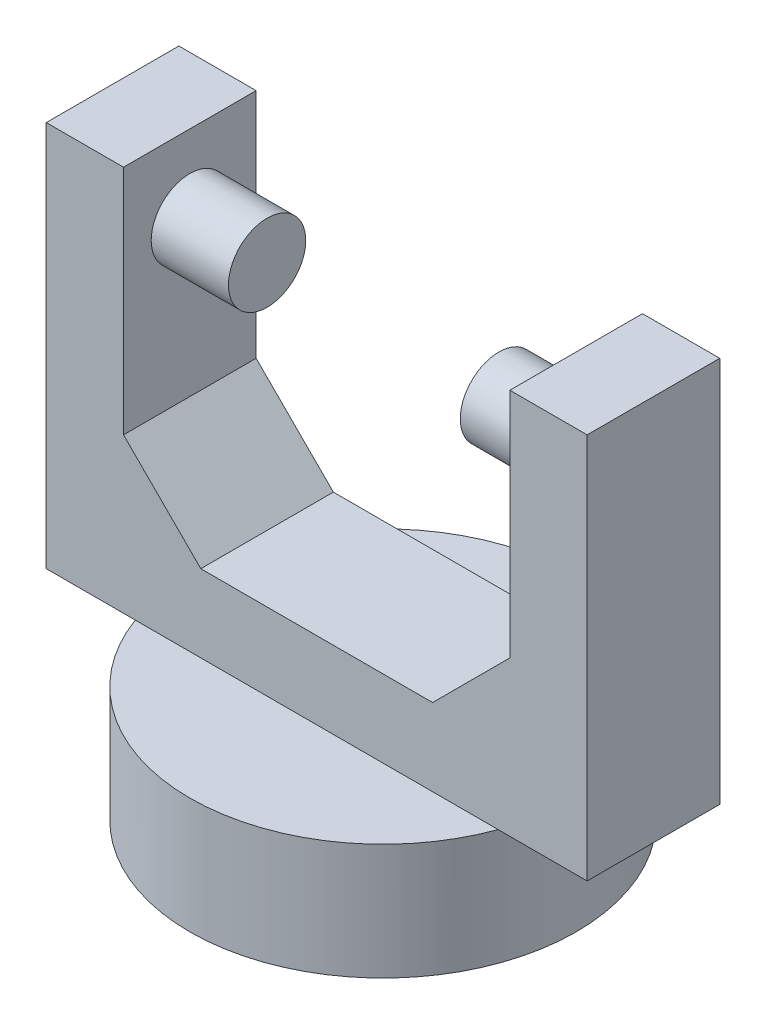
ISO-10303-21;
HEADER;
FILE_DESCRIPTION(('STEP AP214'),'2;1');
FILE_NAME('part.step','',(''),(''),'','','');
FILE_SCHEMA(('AUTOMOTIVE_DESIGN { 1 0 10303 214 1 1 1 1 }'));
ENDSEC;
DATA;
#1=APPLICATION_CONTEXT('core data for automotive mechanical design processes');
#2=APPLICATION_PROTOCOL_DEFINITION('international standard','automotive_design',2000,#1);
#3=PRODUCT_CONTEXT('',#1,'mechanical');
#4=PRODUCT('Part','Part','',(#3));
#5=PRODUCT_RELATED_PRODUCT_CATEGORY('part','',(#4));
#6=PRODUCT_DEFINITION_FORMATION('','',#4);
#7=PRODUCT_DEFINITION_CONTEXT('part definition',#1,'design');
#8=PRODUCT_DEFINITION('design','',#6,#7);
#9=PRODUCT_DEFINITION_SHAPE('','',#8);
#10=(LENGTH_UNIT() NAMED_UNIT(*) SI_UNIT(.MILLI.,.METRE.));
#11=(NAMED_UNIT(*) PLANE_ANGLE_UNIT() SI_UNIT($,.RADIAN.));
#12=(NAMED_UNIT(*) SI_UNIT($,.STERADIAN.) SOLID_ANGLE_UNIT());
#13=UNCERTAINTY_MEASURE_WITH_UNIT(LENGTH_MEASURE(1.E-05),#10,'distance_accuracy_value','');
#14=(GEOMETRIC_REPRESENTATION_CONTEXT(3) GLOBAL_UNCERTAINTY_ASSIGNED_CONTEXT((#13)) GLOBAL_UNIT_ASSIGNED_CONTEXT((#10,
#11,#12)) REPRESENTATION_CONTEXT('',''));
#15=CARTESIAN_POINT('',(0.,0.,0.));
#16=DIRECTION('',(0.,0.,1.));
#17=DIRECTION('',(1.,0.,0.));
#18=AXIS2_PLACEMENT_3D('',#15,#16,#17);
#19=CARTESIAN_POINT('',(0.,32.5,0.));
#20=DIRECTION('',(0.,1.,0.));
#21=DIRECTION('',(0.,0.,1.));
#22=AXIS2_PLACEMENT_3D('',#19,#20,#21);
#23=PLANE('',#22);
#24=DIRECTION('',(0.,0.,1.));
#25=VECTOR('',#24,1.);
#26=CARTESIAN_POINT('',(-12.5,32.5,-4.29038395748194));
#27=LINE('',#26,#25);
#28=CARTESIAN_POINT('',(-12.5,32.5,-4.29038395748194));
#29=VERTEX_POINT('',#28);
#30=CARTESIAN_POINT('',(-12.5,32.5,4.29038395748193));
#31=VERTEX_POINT('',#30);
#32=EDGE_CURVE('E142',#29,#31,#27,.T.);
#33=ORIENTED_EDGE('',*,*,#32,.F.);
#34=DIRECTION('',(-1.,0.,0.));
#35=VECTOR('',#34,1.);
#36=CARTESIAN_POINT('',(-17.5,32.5,-4.29038395748194));
#37=LINE('',#36,#35);
#38=CARTESIAN_POINT('',(-17.5,32.5,-4.29038395748194));
#39=VERTEX_POINT('',#38);
#40=EDGE_CURVE('E161',#29,#39,#37,.T.);
#41=ORIENTED_EDGE('',*,*,#40,.T.);
#42=DIRECTION('',(0.,0.,1.));
#43=VECTOR('',#42,1.);
#44=CARTESIAN_POINT('',(-17.5,32.5,-4.29038395748194));
#45=LINE('',#44,#43);
#46=CARTESIAN_POINT('',(-17.5,32.5,4.29038395748193));
#47=VERTEX_POINT('',#46);
#48=EDGE_CURVE('E153',#39,#47,#45,.T.);
#49=ORIENTED_EDGE('',*,*,#48,.T.);
#50=DIRECTION('',(1.,0.,0.));
#51=VECTOR('',#50,1.);
#52=CARTESIAN_POINT('',(-17.5,32.5,4.29038395748193));
#53=LINE('',#52,#51);
#54=EDGE_CURVE('E132',#47,#31,#53,.T.);
#55=ORIENTED_EDGE('',*,*,#54,.T.);
#56=EDGE_LOOP('',(#33,#41,#49,#55));
#57=FACE_BOUND('',#56,.T.);
#58=ADVANCED_FACE('F39',(#57),#23,.T.);
#59=CARTESIAN_POINT('',(0.,7.5,0.));
#60=DIRECTION('',(0.,1.,0.));
#61=DIRECTION('',(0.,0.,1.));
#62=AXIS2_PLACEMENT_3D('',#59,#60,#61);
#63=PLANE('',#62);
#64=DIRECTION('',(-1.,0.,0.));
#65=VECTOR('',#64,1.);
#66=CARTESIAN_POINT('',(-17.5,7.5,-4.29038395748194));
#67=LINE('',#66,#65);
#68=CARTESIAN_POINT('',(11.7406390583044,7.5,-4.29038395748194));
#69=VERTEX_POINT('',#68);
#70=CARTESIAN_POINT('',(-11.7406390583044,7.5,-4.29038395748194));
#71=VERTEX_POINT('',#70);
#72=EDGE_CURVE('E188',#69,#71,#67,.T.);
#73=ORIENTED_EDGE('',*,*,#72,.F.);
#74=CARTESIAN_POINT('',(0.,7.5,0.));
#75=DIRECTION('',(0.,1.,0.));
#76=DIRECTION('',(0.,0.,1.));
#77=AXIS2_PLACEMENT_3D('',#74,#75,#76);
#78=CIRCLE('',#77,12.5);
#79=EDGE_CURVE('E208',#69,#71,#78,.T.);
#80=ORIENTED_EDGE('',*,*,#79,.T.);
#81=EDGE_LOOP('',(#73,#80));
#82=FACE_BOUND('',#81,.T.);
#83=ADVANCED_FACE('F318',(#82),#63,.T.);
#84=CARTESIAN_POINT('',(0.,7.5,0.));
#85=DIRECTION('',(0.,-1.,0.));
#86=DIRECTION('',(0.,0.,-1.));
#87=AXIS2_PLACEMENT_3D('',#84,#85,#86);
#88=CYLINDRICAL_SURFACE('',#87,12.5);
#89=CARTESIAN_POINT('',(11.7406390583043,7.5,4.29038395748194));
#90=VERTEX_POINT('',#89);
#91=EDGE_CURVE('E204',#90,#69,#78,.T.);
#92=ORIENTED_EDGE('',*,*,#91,.F.);
#93=CARTESIAN_POINT('',(-11.7406390583044,7.5,4.29038395748193));
#94=VERTEX_POINT('',#93);
#95=EDGE_CURVE('E209',#94,#90,#78,.T.);
#96=ORIENTED_EDGE('',*,*,#95,.F.);
#97=EDGE_CURVE('E247',#71,#94,#78,.T.);
#98=ORIENTED_EDGE('',*,*,#97,.F.);
#99=ORIENTED_EDGE('',*,*,#79,.F.);
#100=EDGE_LOOP('',(#92,#96,#98,#99));
#101=FACE_BOUND('',#100,.T.);
#102=CARTESIAN_POINT('',(0.,0.,0.));
#103=DIRECTION('',(0.,1.,0.));
#104=DIRECTION('',(0.,0.,1.));
#105=AXIS2_PLACEMENT_3D('',#102,#103,#104);
#106=CIRCLE('',#105,12.5);
#107=CARTESIAN_POINT('',(0.,0.,12.5));
#108=VERTEX_POINT('',#107);
#109=EDGE_CURVE('E203',#108,#108,#106,.T.);
#110=ORIENTED_EDGE('',*,*,#109,.T.);
#111=EDGE_LOOP('',(#110));
#112=FACE_BOUND('',#111,.T.);
#113=ADVANCED_FACE('F324',(#101,#112),#88,.T.);
#114=DIRECTION('',(1.,0.,0.));
#115=VECTOR('',#114,1.);
#116=CARTESIAN_POINT('',(-17.5,7.5,4.29038395748193));
#117=LINE('',#116,#115);
#118=EDGE_CURVE('E180',#94,#90,#117,.T.);
#119=ORIENTED_EDGE('',*,*,#118,.F.);
#120=ORIENTED_EDGE('',*,*,#95,.T.);
#121=EDGE_LOOP('',(#119,#120));
#122=FACE_BOUND('',#121,.T.);
#123=ADVANCED_FACE('F327',(#122),#63,.T.);
#124=CARTESIAN_POINT('',(0.,0.,0.));
#125=DIRECTION('',(0.,1.,0.));
#126=DIRECTION('',(0.,0.,1.));
#127=AXIS2_PLACEMENT_3D('',#124,#125,#126);
#128=PLANE('',#127);
#129=ORIENTED_EDGE('',*,*,#109,.F.);
#130=EDGE_LOOP('',(#129));
#131=FACE_BOUND('',#130,.T.);
#132=ADVANCED_FACE('F361',(#131),#128,.F.);
#133=CARTESIAN_POINT('',(0.,7.5,0.));
#134=DIRECTION('',(0.,1.,0.));
#135=DIRECTION('',(0.,0.,1.));
#136=AXIS2_PLACEMENT_3D('',#133,#134,#135);
#137=PLANE('',#136);
#138=CARTESIAN_POINT('',(17.5,7.5,4.29038395748194));
#139=VERTEX_POINT('',#138);
#140=EDGE_CURVE('E174',#90,#139,#117,.T.);
#141=ORIENTED_EDGE('',*,*,#140,.F.);
#142=ORIENTED_EDGE('',*,*,#91,.T.);
#143=CARTESIAN_POINT('',(17.5,7.5,-4.29038395748194));
#144=VERTEX_POINT('',#143);
#145=EDGE_CURVE('E184',#144,#69,#67,.T.);
#146=ORIENTED_EDGE('',*,*,#145,.F.);
#147=DIRECTION('',(0.,0.,-1.));
#148=VECTOR('',#147,1.);
#149=CARTESIAN_POINT('',(17.5,7.5,-4.29038395748194));
#150=LINE('',#149,#148);
#151=EDGE_CURVE('E179',#139,#144,#150,.T.);
#152=ORIENTED_EDGE('',*,*,#151,.F.);
#153=EDGE_LOOP('',(#141,#142,#146,#152));
#154=FACE_BOUND('',#153,.T.);
#155=ADVANCED_FACE('F347',(#154),#137,.F.);
#156=CARTESIAN_POINT('',(-17.5,7.5,-4.29038395748194));
#157=VERTEX_POINT('',#156);
#158=EDGE_CURVE('E183',#71,#157,#67,.T.);
#159=ORIENTED_EDGE('',*,*,#158,.F.);
#160=ORIENTED_EDGE('',*,*,#97,.T.);
#161=CARTESIAN_POINT('',(-17.5,7.5,4.29038395748193));
#162=VERTEX_POINT('',#161);
#163=EDGE_CURVE('E175',#162,#94,#117,.T.);
#164=ORIENTED_EDGE('',*,*,#163,.F.);
#165=DIRECTION('',(0.,0.,1.));
#166=VECTOR('',#165,1.);
#167=CARTESIAN_POINT('',(-17.5,7.5,-4.29038395748194));
#168=LINE('',#167,#166);
#169=EDGE_CURVE('E170',#157,#162,#168,.T.);
#170=ORIENTED_EDGE('',*,*,#169,.F.);
#171=EDGE_LOOP('',(#159,#160,#164,#170));
#172=FACE_BOUND('',#171,.T.);
#173=ADVANCED_FACE('F354',(#172),#137,.F.);
#174=CARTESIAN_POINT('',(-17.5,32.5,-4.29038395748194));
#175=DIRECTION('',(1.,0.,0.));
#176=DIRECTION('',(0.,0.,-1.));
#177=AXIS2_PLACEMENT_3D('',#174,#175,#176);
#178=PLANE('',#177);
#179=ORIENTED_EDGE('',*,*,#169,.T.);
#180=DIRECTION('',(0.,-1.,0.));
#181=VECTOR('',#180,1.);
#182=CARTESIAN_POINT('',(-17.5,32.5,4.29038395748193));
#183=LINE('',#182,#181);
#184=EDGE_CURVE('E200',#47,#162,#183,.T.);
#185=ORIENTED_EDGE('',*,*,#184,.F.);
#186=ORIENTED_EDGE('',*,*,#48,.F.);
#187=DIRECTION('',(0.,-1.,0.));
#188=VECTOR('',#187,1.);
#189=CARTESIAN_POINT('',(-17.5,32.5,-4.29038395748194));
#190=LINE('',#189,#188);
#191=EDGE_CURVE('E169',#39,#157,#190,.T.);
#192=ORIENTED_EDGE('',*,*,#191,.T.);
#193=EDGE_LOOP('',(#179,#185,#186,#192));
#194=FACE_BOUND('',#193,.T.);
#195=ADVANCED_FACE('F257',(#194),#178,.F.);
#196=CARTESIAN_POINT('',(-17.5,32.5,4.29038395748193));
#197=DIRECTION('',(0.,0.,-1.));
#198=DIRECTION('',(-1.,0.,0.));
#199=AXIS2_PLACEMENT_3D('',#196,#197,#198);
#200=PLANE('',#199);
#201=DIRECTION('',(1.,0.,0.));
#202=VECTOR('',#201,1.);
#203=CARTESIAN_POINT('',(-12.5,12.5,4.29038395748193));
#204=LINE('',#203,#202);
#205=CARTESIAN_POINT('',(-7.49999999999997,12.5,4.29038395748193));
#206=VERTEX_POINT('',#205);
#207=CARTESIAN_POINT('',(7.49999999999997,12.5,4.29038395748193));
#208=VERTEX_POINT('',#207);
#209=EDGE_CURVE('E270',#206,#208,#204,.T.);
#210=ORIENTED_EDGE('',*,*,#209,.F.);
#211=DIRECTION('',(-0.707106781186551,0.707106781186544,0.));
#212=VECTOR('',#211,1.);
#213=CARTESIAN_POINT('',(-22.5,27.4999999999999,4.29038395748193));
#214=LINE('',#213,#212);
#215=CARTESIAN_POINT('',(-12.5,17.5,4.29038395748193));
#216=VERTEX_POINT('',#215);
#217=EDGE_CURVE('E134',#206,#216,#214,.T.);
#218=ORIENTED_EDGE('',*,*,#217,.T.);
#219=DIRECTION('',(0.,1.,0.));
#220=VECTOR('',#219,1.);
#221=CARTESIAN_POINT('',(-12.5,12.5,4.29038395748193));
#222=LINE('',#221,#220);
#223=EDGE_CURVE('E126',#216,#31,#222,.T.);
#224=ORIENTED_EDGE('',*,*,#223,.T.);
#225=ORIENTED_EDGE('',*,*,#54,.F.);
#226=ORIENTED_EDGE('',*,*,#184,.T.);
#227=ORIENTED_EDGE('',*,*,#163,.T.);
#228=ORIENTED_EDGE('',*,*,#118,.T.);
#229=ORIENTED_EDGE('',*,*,#140,.T.);
#230=DIRECTION('',(0.,-1.,0.));
#231=VECTOR('',#230,1.);
#232=CARTESIAN_POINT('',(17.5,32.5,4.29038395748194));
#233=LINE('',#232,#231);
#234=CARTESIAN_POINT('',(17.5,32.5,4.29038395748194));
#235=VERTEX_POINT('',#234);
#236=EDGE_CURVE('E196',#235,#139,#233,.T.);
#237=ORIENTED_EDGE('',*,*,#236,.F.);
#238=CARTESIAN_POINT('',(12.5,32.5,4.29038395748194));
#239=VERTEX_POINT('',#238);
#240=EDGE_CURVE('E157',#239,#235,#53,.T.);
#241=ORIENTED_EDGE('',*,*,#240,.F.);
#242=DIRECTION('',(0.,1.,0.));
#243=VECTOR('',#242,1.);
#244=CARTESIAN_POINT('',(12.5,12.5,4.29038395748193));
#245=LINE('',#244,#243);
#246=CARTESIAN_POINT('',(12.5,17.5,4.29038395748193));
#247=VERTEX_POINT('',#246);
#248=EDGE_CURVE('E138',#247,#239,#245,.T.);
#249=ORIENTED_EDGE('',*,*,#248,.F.);
#250=DIRECTION('',(-0.707106781186551,-0.707106781186544,0.));
#251=VECTOR('',#250,1.);
#252=CARTESIAN_POINT('',(4.99999999999987,9.99999999999991,4.29038395748193));
#253=LINE('',#252,#251);
#254=EDGE_CURVE('E11',#247,#208,#253,.T.);
#255=ORIENTED_EDGE('',*,*,#254,.T.);
#256=EDGE_LOOP('',(#210,#218,#224,#225,#226,#227,#228,#229,#237,#241,#249,#255));
#257=FACE_BOUND('',#256,.T.);
#258=ADVANCED_FACE('F129',(#257),#200,.F.);
#259=CARTESIAN_POINT('',(17.5,32.5,-4.29038395748194));
#260=DIRECTION('',(-1.,0.,0.));
#261=DIRECTION('',(0.,0.,1.));
#262=AXIS2_PLACEMENT_3D('',#259,#260,#261);
#263=PLANE('',#262);
#264=ORIENTED_EDGE('',*,*,#151,.T.);
#265=DIRECTION('',(0.,-1.,0.));
#266=VECTOR('',#265,1.);
#267=CARTESIAN_POINT('',(17.5,32.5,-4.29038395748194));
#268=LINE('',#267,#266);
#269=CARTESIAN_POINT('',(17.5,32.5,-4.29038395748194));
#270=VERTEX_POINT('',#269);
#271=EDGE_CURVE('E192',#270,#144,#268,.T.);
#272=ORIENTED_EDGE('',*,*,#271,.F.);
#273=DIRECTION('',(0.,0.,-1.));
#274=VECTOR('',#273,1.);
#275=CARTESIAN_POINT('',(17.5,32.5,-4.29038395748194));
#276=LINE('',#275,#274);
#277=EDGE_CURVE('E156',#235,#270,#276,.T.);
#278=ORIENTED_EDGE('',*,*,#277,.F.);
#279=ORIENTED_EDGE('',*,*,#236,.T.);
#280=EDGE_LOOP('',(#264,#272,#278,#279));
#281=FACE_BOUND('',#280,.T.);
#282=ADVANCED_FACE('F337',(#281),#263,.F.);
#283=CARTESIAN_POINT('',(-17.5,32.5,-4.29038395748194));
#284=DIRECTION('',(0.,0.,1.));
#285=DIRECTION('',(1.,0.,0.));
#286=AXIS2_PLACEMENT_3D('',#283,#284,#285);
#287=PLANE('',#286);
#288=ORIENTED_EDGE('',*,*,#40,.F.);
#289=DIRECTION('',(0.,1.,0.));
#290=VECTOR('',#289,1.);
#291=CARTESIAN_POINT('',(-12.5,12.5,-4.29038395748194));
#292=LINE('',#291,#290);
#293=CARTESIAN_POINT('',(-12.5,17.5,-4.29038395748194));
#294=VERTEX_POINT('',#293);
#295=EDGE_CURVE('E145',#294,#29,#292,.T.);
#296=ORIENTED_EDGE('',*,*,#295,.F.);
#297=DIRECTION('',(0.707106781186551,-0.707106781186544,0.));
#298=VECTOR('',#297,1.);
#299=CARTESIAN_POINT('',(-22.5,27.4999999999999,-4.29038395748194));
#300=LINE('',#299,#298);
#301=CARTESIAN_POINT('',(-7.49999999999997,12.5,-4.29038395748194));
#302=VERTEX_POINT('',#301);
#303=EDGE_CURVE('E230',#294,#302,#300,.T.);
#304=ORIENTED_EDGE('',*,*,#303,.T.);
#305=DIRECTION('',(-1.,0.,0.));
#306=VECTOR('',#305,1.);
#307=CARTESIAN_POINT('',(-12.5,12.5,-4.29038395748194));
#308=LINE('',#307,#306);
#309=CARTESIAN_POINT('',(7.49999999999996,12.5,-4.29038395748194));
#310=VERTEX_POINT('',#309);
#311=EDGE_CURVE('E139',#310,#302,#308,.T.);
#312=ORIENTED_EDGE('',*,*,#311,.F.);
#313=DIRECTION('',(0.707106781186551,0.707106781186544,0.));
#314=VECTOR('',#313,1.);
#315=CARTESIAN_POINT('',(4.99999999999987,9.99999999999991,-4.29038395748194));
#316=LINE('',#315,#314);
#317=CARTESIAN_POINT('',(12.5,17.5,-4.29038395748194));
#318=VERTEX_POINT('',#317);
#319=EDGE_CURVE('E48',#310,#318,#316,.T.);
#320=ORIENTED_EDGE('',*,*,#319,.T.);
#321=DIRECTION('',(0.,1.,0.));
#322=VECTOR('',#321,1.);
#323=CARTESIAN_POINT('',(12.5,12.5,-4.29038395748194));
#324=LINE('',#323,#322);
#325=CARTESIAN_POINT('',(12.5,32.5,-4.29038395748194));
#326=VERTEX_POINT('',#325);
#327=EDGE_CURVE('E263',#318,#326,#324,.T.);
#328=ORIENTED_EDGE('',*,*,#327,.T.);
#329=EDGE_CURVE('E165',#270,#326,#37,.T.);
#330=ORIENTED_EDGE('',*,*,#329,.F.);
#331=ORIENTED_EDGE('',*,*,#271,.T.);
#332=ORIENTED_EDGE('',*,*,#145,.T.);
#333=ORIENTED_EDGE('',*,*,#72,.T.);
#334=ORIENTED_EDGE('',*,*,#158,.T.);
#335=ORIENTED_EDGE('',*,*,#191,.F.);
#336=EDGE_LOOP('',(#288,#296,#304,#312,#320,#328,#330,#331,#332,#333,#334,#335));
#337=FACE_BOUND('',#336,.T.);
#338=ADVANCED_FACE('F253',(#337),#287,.F.);
#339=DIRECTION('',(0.,0.,-1.));
#340=VECTOR('',#339,1.);
#341=CARTESIAN_POINT('',(12.5,32.5,-4.29038395748194));
#342=LINE('',#341,#340);
#343=EDGE_CURVE('E149',#239,#326,#342,.T.);
#344=ORIENTED_EDGE('',*,*,#343,.F.);
#345=ORIENTED_EDGE('',*,*,#240,.T.);
#346=ORIENTED_EDGE('',*,*,#277,.T.);
#347=ORIENTED_EDGE('',*,*,#329,.T.);
#348=EDGE_LOOP('',(#344,#345,#346,#347));
#349=FACE_BOUND('',#348,.T.);
#350=ADVANCED_FACE('F320',(#349),#23,.T.);
#351=CARTESIAN_POINT('',(-12.5,12.5,-4.29038395748194));
#352=DIRECTION('',(-1.,0.,0.));
#353=DIRECTION('',(0.,0.,1.));
#354=AXIS2_PLACEMENT_3D('',#351,#352,#353);
#355=PLANE('',#354);
#356=CARTESIAN_POINT('',(-12.5,27.5,0.));
#357=DIRECTION('',(-1.,0.,0.));
#358=DIRECTION('',(0.,0.,1.));
#359=AXIS2_PLACEMENT_3D('',#356,#357,#358);
#360=CIRCLE('',#359,2.5);
#361=CARTESIAN_POINT('',(-12.5,27.5,2.5));
#362=VERTEX_POINT('',#361);
#363=EDGE_CURVE('E213',#362,#362,#360,.F.);
#364=ORIENTED_EDGE('',*,*,#363,.F.);
#365=EDGE_LOOP('',(#364));
#366=FACE_BOUND('',#365,.T.);
#367=ORIENTED_EDGE('',*,*,#223,.F.);
#368=DIRECTION('',(0.,0.,-1.));
#369=VECTOR('',#368,1.);
#370=CARTESIAN_POINT('',(-12.5,17.5,-4.29038395748194));
#371=LINE('',#370,#369);
#372=EDGE_CURVE('E225',#216,#294,#371,.T.);
#373=ORIENTED_EDGE('',*,*,#372,.T.);
#374=ORIENTED_EDGE('',*,*,#295,.T.);
#375=ORIENTED_EDGE('',*,*,#32,.T.);
#376=EDGE_LOOP('',(#367,#373,#374,#375));
#377=FACE_BOUND('',#376,.T.);
#378=ADVANCED_FACE('F143',(#366,#377),#355,.F.);
#379=CARTESIAN_POINT('',(12.5,12.5,-4.29038395748194));
#380=DIRECTION('',(1.,0.,0.));
#381=DIRECTION('',(0.,0.,-1.));
#382=AXIS2_PLACEMENT_3D('',#379,#380,#381);
#383=PLANE('',#382);
#384=CARTESIAN_POINT('',(12.5,27.5,0.));
#385=DIRECTION('',(1.,0.,0.));
#386=DIRECTION('',(0.,0.,-1.));
#387=AXIS2_PLACEMENT_3D('',#384,#385,#386);
#388=CIRCLE('',#387,2.5);
#389=CARTESIAN_POINT('',(12.5,27.5,-2.5));
#390=VERTEX_POINT('',#389);
#391=EDGE_CURVE('E217',#390,#390,#388,.F.);
#392=ORIENTED_EDGE('',*,*,#391,.F.);
#393=EDGE_LOOP('',(#392));
#394=FACE_BOUND('',#393,.T.);
#395=ORIENTED_EDGE('',*,*,#327,.F.);
#396=DIRECTION('',(0.,0.,1.));
#397=VECTOR('',#396,1.);
#398=CARTESIAN_POINT('',(12.5,17.5,-4.29038395748194));
#399=LINE('',#398,#397);
#400=EDGE_CURVE('E55',#318,#247,#399,.T.);
#401=ORIENTED_EDGE('',*,*,#400,.T.);
#402=ORIENTED_EDGE('',*,*,#248,.T.);
#403=ORIENTED_EDGE('',*,*,#343,.T.);
#404=EDGE_LOOP('',(#395,#401,#402,#403));
#405=FACE_BOUND('',#404,.T.);
#406=ADVANCED_FACE('F295',(#394,#405),#383,.F.);
#407=CARTESIAN_POINT('',(0.,12.5,0.));
#408=DIRECTION('',(0.,1.,0.));
#409=DIRECTION('',(0.,0.,1.));
#410=AXIS2_PLACEMENT_3D('',#407,#408,#409);
#411=PLANE('',#410);
#412=ORIENTED_EDGE('',*,*,#209,.T.);
#413=DIRECTION('',(0.,0.,-1.));
#414=VECTOR('',#413,1.);
#415=CARTESIAN_POINT('',(7.49999999999997,12.5,0.));
#416=LINE('',#415,#414);
#417=EDGE_CURVE('E234',#208,#310,#416,.T.);
#418=ORIENTED_EDGE('',*,*,#417,.T.);
#419=ORIENTED_EDGE('',*,*,#311,.T.);
#420=DIRECTION('',(0.,0.,1.));
#421=VECTOR('',#420,1.);
#422=CARTESIAN_POINT('',(-7.49999999999997,12.5,0.));
#423=LINE('',#422,#421);
#424=EDGE_CURVE('E221',#302,#206,#423,.T.);
#425=ORIENTED_EDGE('',*,*,#424,.T.);
#426=EDGE_LOOP('',(#412,#418,#419,#425));
#427=FACE_BOUND('',#426,.T.);
#428=ADVANCED_FACE('F297',(#427),#411,.T.);
#429=CARTESIAN_POINT('',(-7.5,27.5,0.));
#430=DIRECTION('',(-1.,0.,0.));
#431=DIRECTION('',(0.,0.,1.));
#432=AXIS2_PLACEMENT_3D('',#429,#430,#431);
#433=CYLINDRICAL_SURFACE('',#432,2.5);
#434=CARTESIAN_POINT('',(-7.5,27.5,0.));
#435=DIRECTION('',(1.,0.,0.));
#436=DIRECTION('',(0.,0.,-1.));
#437=AXIS2_PLACEMENT_3D('',#434,#435,#436);
#438=CIRCLE('',#437,2.5);
#439=CARTESIAN_POINT('',(-7.5,27.5,-2.5));
#440=VERTEX_POINT('',#439);
#441=EDGE_CURVE('E150',#440,#440,#438,.T.);
#442=ORIENTED_EDGE('',*,*,#441,.F.);
#443=EDGE_LOOP('',(#442));
#444=FACE_BOUND('',#443,.T.);
#445=ORIENTED_EDGE('',*,*,#363,.T.);
#446=EDGE_LOOP('',(#445));
#447=FACE_BOUND('',#446,.T.);
#448=ADVANCED_FACE('F420',(#444,#447),#433,.T.);
#449=CARTESIAN_POINT('',(-7.5,27.5,0.));
#450=DIRECTION('',(1.,0.,0.));
#451=DIRECTION('',(0.,0.,-1.));
#452=AXIS2_PLACEMENT_3D('',#449,#450,#451);
#453=PLANE('',#452);
#454=ORIENTED_EDGE('',*,*,#441,.T.);
#455=EDGE_LOOP('',(#454));
#456=FACE_BOUND('',#455,.T.);
#457=ADVANCED_FACE('F291',(#456),#453,.T.);
#458=CARTESIAN_POINT('',(7.5,27.5,0.));
#459=DIRECTION('',(1.,0.,0.));
#460=DIRECTION('',(0.,0.,-1.));
#461=AXIS2_PLACEMENT_3D('',#458,#459,#460);
#462=CYLINDRICAL_SURFACE('',#461,2.5);
#463=CARTESIAN_POINT('',(7.5,27.5,0.));
#464=DIRECTION('',(-1.,0.,0.));
#465=DIRECTION('',(0.,0.,1.));
#466=AXIS2_PLACEMENT_3D('',#463,#464,#465);
#467=CIRCLE('',#466,2.5);
#468=CARTESIAN_POINT('',(7.5,27.5,2.5));
#469=VERTEX_POINT('',#468);
#470=EDGE_CURVE('E280',#469,#469,#467,.T.);
#471=ORIENTED_EDGE('',*,*,#470,.F.);
#472=EDGE_LOOP('',(#471));
#473=FACE_BOUND('',#472,.T.);
#474=ORIENTED_EDGE('',*,*,#391,.T.);
#475=EDGE_LOOP('',(#474));
#476=FACE_BOUND('',#475,.T.);
#477=ADVANCED_FACE('F288',(#473,#476),#462,.T.);
#478=CARTESIAN_POINT('',(7.5,27.5,0.));
#479=DIRECTION('',(-1.,0.,0.));
#480=DIRECTION('',(0.,0.,1.));
#481=AXIS2_PLACEMENT_3D('',#478,#479,#480);
#482=PLANE('',#481);
#483=ORIENTED_EDGE('',*,*,#470,.T.);
#484=EDGE_LOOP('',(#483));
#485=FACE_BOUND('',#484,.T.);
#486=ADVANCED_FACE('F286',(#485),#482,.T.);
#487=CARTESIAN_POINT('',(-7.49999999999997,12.5,0.));
#488=DIRECTION('',(-0.707106781186544,-0.707106781186551,0.));
#489=DIRECTION('',(0.,0.,1.));
#490=AXIS2_PLACEMENT_3D('',#487,#488,#489);
#491=PLANE('',#490);
#492=ORIENTED_EDGE('',*,*,#303,.F.);
#493=ORIENTED_EDGE('',*,*,#372,.F.);
#494=ORIENTED_EDGE('',*,*,#217,.F.);
#495=ORIENTED_EDGE('',*,*,#424,.F.);
#496=EDGE_LOOP('',(#492,#493,#494,#495));
#497=FACE_BOUND('',#496,.T.);
#498=ADVANCED_FACE('F309',(#497),#491,.F.);
#499=CARTESIAN_POINT('',(7.49999999999997,12.5,0.));
#500=DIRECTION('',(0.707106781186544,-0.707106781186551,0.));
#501=DIRECTION('',(0.,0.,-1.));
#502=AXIS2_PLACEMENT_3D('',#499,#500,#501);
#503=PLANE('',#502);
#504=ORIENTED_EDGE('',*,*,#254,.F.);
#505=ORIENTED_EDGE('',*,*,#400,.F.);
#506=ORIENTED_EDGE('',*,*,#319,.F.);
#507=ORIENTED_EDGE('',*,*,#417,.F.);
#508=EDGE_LOOP('',(#504,#505,#506,#507));
#509=FACE_BOUND('',#508,.T.);
#510=ADVANCED_FACE('F41',(#509),#503,.F.);
#511=CLOSED_SHELL('',(#58,#83,#113,#123,#132,#155,#173,#195,#258,#282,#338,#350,#378,#406,#428,
#448,#457,#477,#486,#498,#510));
#512=MANIFOLD_SOLID_BREP('B2',#511);
#513=ADVANCED_BREP_SHAPE_REPRESENTATION('',(#18,#512),#14);
#514=SHAPE_DEFINITION_REPRESENTATION(#9,#513);
ENDSEC;
END-ISO-10303-21;
